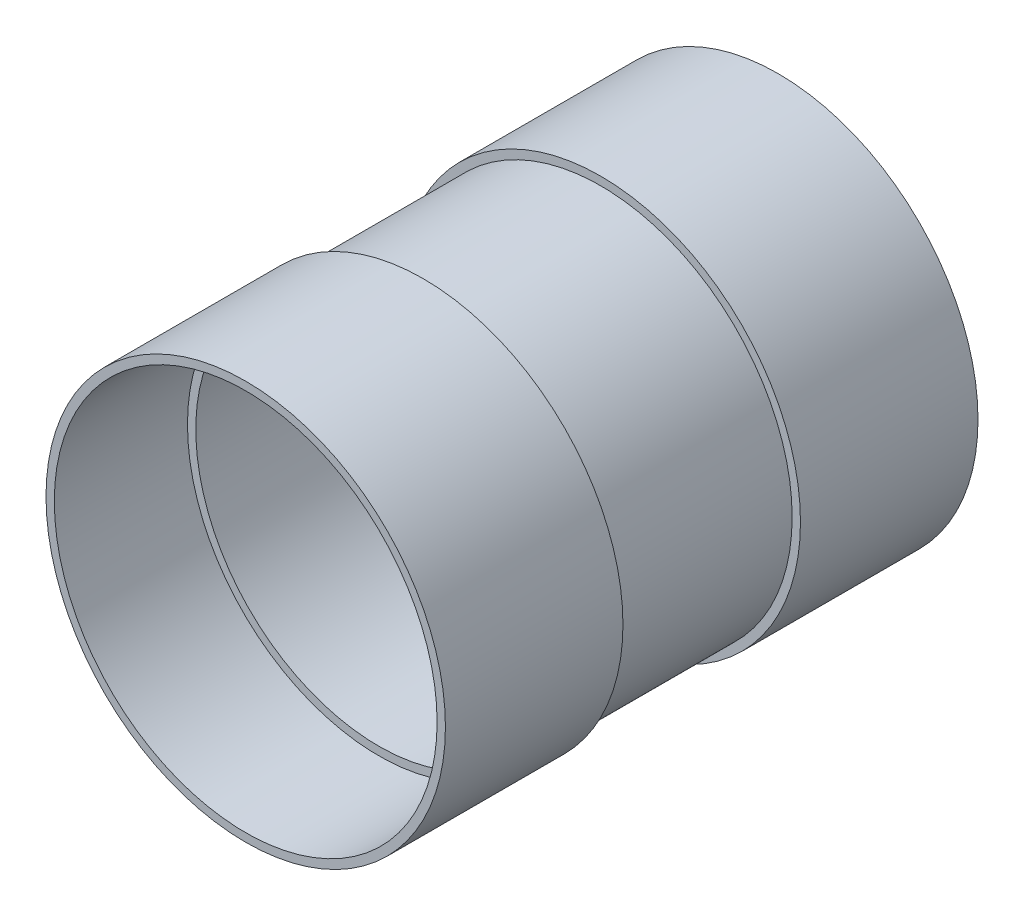
ISO-10303-21;
HEADER;
FILE_DESCRIPTION(('STEP AP214'),'2;1');
FILE_NAME('part.step','',(''),(''),'','','');
FILE_SCHEMA(('AUTOMOTIVE_DESIGN { 1 0 10303 214 1 1 1 1 }'));
ENDSEC;
DATA;
#1=APPLICATION_CONTEXT('core data for automotive mechanical design processes');
#2=APPLICATION_PROTOCOL_DEFINITION('international standard','automotive_design',2000,#1);
#3=PRODUCT_CONTEXT('',#1,'mechanical');
#4=PRODUCT('Part','Part','',(#3));
#5=PRODUCT_RELATED_PRODUCT_CATEGORY('part','',(#4));
#6=PRODUCT_DEFINITION_FORMATION('','',#4);
#7=PRODUCT_DEFINITION_CONTEXT('part definition',#1,'design');
#8=PRODUCT_DEFINITION('design','',#6,#7);
#9=PRODUCT_DEFINITION_SHAPE('','',#8);
#10=(LENGTH_UNIT() NAMED_UNIT(*) SI_UNIT(.MILLI.,.METRE.));
#11=(NAMED_UNIT(*) PLANE_ANGLE_UNIT() SI_UNIT($,.RADIAN.));
#12=(NAMED_UNIT(*) SI_UNIT($,.STERADIAN.) SOLID_ANGLE_UNIT());
#13=UNCERTAINTY_MEASURE_WITH_UNIT(LENGTH_MEASURE(1.E-05),#10,'distance_accuracy_value','');
#14=(GEOMETRIC_REPRESENTATION_CONTEXT(3) GLOBAL_UNCERTAINTY_ASSIGNED_CONTEXT((#13)) GLOBAL_UNIT_ASSIGNED_CONTEXT((#10,
#11,#12)) REPRESENTATION_CONTEXT('',''));
#15=CARTESIAN_POINT('',(0.,0.,0.));
#16=DIRECTION('',(0.,0.,1.));
#17=DIRECTION('',(1.,0.,0.));
#18=AXIS2_PLACEMENT_3D('',#15,#16,#17);
#19=CARTESIAN_POINT('',(0.,104.775,76.2000000000001));
#20=DIRECTION('',(0.,0.,-1.));
#21=DIRECTION('',(-1.,0.,0.));
#22=AXIS2_PLACEMENT_3D('',#19,#20,#21);
#23=PLANE('',#22);
#24=CARTESIAN_POINT('',(0.,0.,76.2000000000001));
#25=DIRECTION('',(0.,0.,1.));
#26=DIRECTION('',(1.,0.,0.));
#27=AXIS2_PLACEMENT_3D('',#24,#25,#26);
#28=CIRCLE('',#27,104.775);
#29=CARTESIAN_POINT('',(104.775,0.,76.2000000000001));
#30=VERTEX_POINT('',#29);
#31=EDGE_CURVE('E73',#30,#30,#28,.T.);
#32=ORIENTED_EDGE('',*,*,#31,.F.);
#33=EDGE_LOOP('',(#32));
#34=FACE_BOUND('',#33,.T.);
#35=CARTESIAN_POINT('',(0.,0.,76.2000000000001));
#36=DIRECTION('',(0.,0.,1.));
#37=DIRECTION('',(1.,0.,0.));
#38=AXIS2_PLACEMENT_3D('',#35,#36,#37);
#39=CIRCLE('',#38,109.5375);
#40=CARTESIAN_POINT('',(109.5375,0.,76.2000000000001));
#41=VERTEX_POINT('',#40);
#42=EDGE_CURVE('E11',#41,#41,#39,.T.);
#43=ORIENTED_EDGE('',*,*,#42,.T.);
#44=EDGE_LOOP('',(#43));
#45=FACE_BOUND('',#44,.T.);
#46=ADVANCED_FACE('F52',(#34,#45),#23,.F.);
#47=CARTESIAN_POINT('',(0.,0.,0.));
#48=DIRECTION('',(0.,0.,1.));
#49=DIRECTION('',(1.,0.,0.));
#50=AXIS2_PLACEMENT_3D('',#47,#48,#49);
#51=CYLINDRICAL_SURFACE('',#50,109.5375);
#52=ORIENTED_EDGE('',*,*,#42,.F.);
#53=EDGE_LOOP('',(#52));
#54=FACE_BOUND('',#53,.T.);
#55=CARTESIAN_POINT('',(0.,0.,-76.2000000000001));
#56=DIRECTION('',(0.,0.,1.));
#57=DIRECTION('',(1.,0.,0.));
#58=AXIS2_PLACEMENT_3D('',#55,#56,#57);
#59=CIRCLE('',#58,109.5375);
#60=CARTESIAN_POINT('',(109.5375,0.,-76.2000000000001));
#61=VERTEX_POINT('',#60);
#62=EDGE_CURVE('E59',#61,#61,#59,.T.);
#63=ORIENTED_EDGE('',*,*,#62,.T.);
#64=EDGE_LOOP('',(#63));
#65=FACE_BOUND('',#64,.T.);
#66=ADVANCED_FACE('F85',(#54,#65),#51,.T.);
#67=CARTESIAN_POINT('',(0.,104.775,-76.2000000000001));
#68=DIRECTION('',(0.,0.,1.));
#69=DIRECTION('',(1.,0.,0.));
#70=AXIS2_PLACEMENT_3D('',#67,#68,#69);
#71=PLANE('',#70);
#72=ORIENTED_EDGE('',*,*,#62,.F.);
#73=EDGE_LOOP('',(#72));
#74=FACE_BOUND('',#73,.T.);
#75=CARTESIAN_POINT('',(0.,0.,-76.2000000000001));
#76=DIRECTION('',(0.,0.,1.));
#77=DIRECTION('',(1.,0.,0.));
#78=AXIS2_PLACEMENT_3D('',#75,#76,#77);
#79=CIRCLE('',#78,104.775);
#80=CARTESIAN_POINT('',(104.775,0.,-76.2000000000001));
#81=VERTEX_POINT('',#80);
#82=EDGE_CURVE('E66',#81,#81,#79,.T.);
#83=ORIENTED_EDGE('',*,*,#82,.T.);
#84=EDGE_LOOP('',(#83));
#85=FACE_BOUND('',#84,.T.);
#86=ADVANCED_FACE('F89',(#74,#85),#71,.F.);
#87=CARTESIAN_POINT('',(0.,0.,0.));
#88=DIRECTION('',(0.,0.,1.));
#89=DIRECTION('',(1.,0.,0.));
#90=AXIS2_PLACEMENT_3D('',#87,#88,#89);
#91=CYLINDRICAL_SURFACE('',#90,104.775);
#92=ORIENTED_EDGE('',*,*,#82,.F.);
#93=EDGE_LOOP('',(#92));
#94=FACE_BOUND('',#93,.T.);
#95=ORIENTED_EDGE('',*,*,#31,.T.);
#96=EDGE_LOOP('',(#95));
#97=FACE_BOUND('',#96,.T.);
#98=ADVANCED_FACE('F82',(#94,#97),#91,.F.);
#99=CLOSED_SHELL('',(#46,#66,#86,#98));
#100=MANIFOLD_SOLID_BREP('B2',#99);
#101=CARTESIAN_POINT('',(0.,114.3,-50.8000000000001));
#102=DIRECTION('',(0.,0.,-1.));
#103=DIRECTION('',(-1.,0.,0.));
#104=AXIS2_PLACEMENT_3D('',#101,#102,#103);
#105=PLANE('',#104);
#106=CARTESIAN_POINT('',(0.,0.,-50.8000000000001));
#107=DIRECTION('',(0.,0.,1.));
#108=DIRECTION('',(1.,0.,0.));
#109=AXIS2_PLACEMENT_3D('',#106,#107,#108);
#110=CIRCLE('',#109,109.5375);
#111=CARTESIAN_POINT('',(109.5375,0.,-50.8000000000001));
#112=VERTEX_POINT('',#111);
#113=EDGE_CURVE('E51',#112,#112,#110,.T.);
#114=ORIENTED_EDGE('',*,*,#113,.F.);
#115=EDGE_LOOP('',(#114));
#116=FACE_BOUND('',#115,.T.);
#117=CARTESIAN_POINT('',(0.,0.,-50.8000000000001));
#118=DIRECTION('',(0.,0.,1.));
#119=DIRECTION('',(1.,0.,0.));
#120=AXIS2_PLACEMENT_3D('',#117,#118,#119);
#121=CIRCLE('',#120,114.3);
#122=CARTESIAN_POINT('',(114.3,0.,-50.8000000000001));
#123=VERTEX_POINT('',#122);
#124=EDGE_CURVE('E160',#123,#123,#121,.T.);
#125=ORIENTED_EDGE('',*,*,#124,.T.);
#126=EDGE_LOOP('',(#125));
#127=FACE_BOUND('',#126,.T.);
#128=ADVANCED_FACE('F141',(#116,#127),#105,.F.);
#129=CARTESIAN_POINT('',(0.,0.,62.5945817490495));
#130=DIRECTION('',(0.,0.,1.));
#131=DIRECTION('',(1.,0.,0.));
#132=AXIS2_PLACEMENT_3D('',#129,#130,#131);
#133=CYLINDRICAL_SURFACE('',#132,109.5375);
#134=CARTESIAN_POINT('',(0.,0.,-152.4));
#135=DIRECTION('',(0.,0.,1.));
#136=DIRECTION('',(1.,0.,0.));
#137=AXIS2_PLACEMENT_3D('',#134,#135,#136);
#138=CIRCLE('',#137,109.5375);
#139=CARTESIAN_POINT('',(109.5375,0.,-152.4));
#140=VERTEX_POINT('',#139);
#141=EDGE_CURVE('E148',#140,#140,#138,.T.);
#142=ORIENTED_EDGE('',*,*,#141,.F.);
#143=EDGE_LOOP('',(#142));
#144=FACE_BOUND('',#143,.T.);
#145=ORIENTED_EDGE('',*,*,#113,.T.);
#146=EDGE_LOOP('',(#145));
#147=FACE_BOUND('',#146,.T.);
#148=ADVANCED_FACE('F177',(#144,#147),#133,.F.);
#149=CARTESIAN_POINT('',(0.,114.3,-152.4));
#150=DIRECTION('',(0.,0.,1.));
#151=DIRECTION('',(1.,0.,0.));
#152=AXIS2_PLACEMENT_3D('',#149,#150,#151);
#153=PLANE('',#152);
#154=CARTESIAN_POINT('',(0.,0.,-152.4));
#155=DIRECTION('',(0.,0.,1.));
#156=DIRECTION('',(1.,0.,0.));
#157=AXIS2_PLACEMENT_3D('',#154,#155,#156);
#158=CIRCLE('',#157,114.3);
#159=CARTESIAN_POINT('',(114.3,0.,-152.4));
#160=VERTEX_POINT('',#159);
#161=EDGE_CURVE('E154',#160,#160,#158,.T.);
#162=ORIENTED_EDGE('',*,*,#161,.F.);
#163=EDGE_LOOP('',(#162));
#164=FACE_BOUND('',#163,.T.);
#165=ORIENTED_EDGE('',*,*,#141,.T.);
#166=EDGE_LOOP('',(#165));
#167=FACE_BOUND('',#166,.T.);
#168=ADVANCED_FACE('F172',(#164,#167),#153,.F.);
#169=CARTESIAN_POINT('',(0.,0.,62.5945817490495));
#170=DIRECTION('',(0.,0.,1.));
#171=DIRECTION('',(1.,0.,0.));
#172=AXIS2_PLACEMENT_3D('',#169,#170,#171);
#173=CYLINDRICAL_SURFACE('',#172,114.3);
#174=ORIENTED_EDGE('',*,*,#124,.F.);
#175=EDGE_LOOP('',(#174));
#176=FACE_BOUND('',#175,.T.);
#177=ORIENTED_EDGE('',*,*,#161,.T.);
#178=EDGE_LOOP('',(#177));
#179=FACE_BOUND('',#178,.T.);
#180=ADVANCED_FACE('F169',(#176,#179),#173,.T.);
#181=CLOSED_SHELL('',(#128,#148,#168,#180));
#182=MANIFOLD_SOLID_BREP('B6',#181);
#183=CARTESIAN_POINT('',(0.,109.5375,152.4));
#184=DIRECTION('',(0.,0.,-1.));
#185=DIRECTION('',(-1.,0.,0.));
#186=AXIS2_PLACEMENT_3D('',#183,#184,#185);
#187=PLANE('',#186);
#188=CARTESIAN_POINT('',(0.,0.,152.4));
#189=DIRECTION('',(0.,0.,1.));
#190=DIRECTION('',(1.,0.,0.));
#191=AXIS2_PLACEMENT_3D('',#188,#189,#190);
#192=CIRCLE('',#191,109.5375);
#193=CARTESIAN_POINT('',(109.5375,0.,152.4));
#194=VERTEX_POINT('',#193);
#195=EDGE_CURVE('E238',#194,#194,#192,.T.);
#196=ORIENTED_EDGE('',*,*,#195,.F.);
#197=EDGE_LOOP('',(#196));
#198=FACE_BOUND('',#197,.T.);
#199=CARTESIAN_POINT('',(0.,0.,152.4));
#200=DIRECTION('',(0.,0.,1.));
#201=DIRECTION('',(1.,0.,0.));
#202=AXIS2_PLACEMENT_3D('',#199,#200,#201);
#203=CIRCLE('',#202,114.3);
#204=CARTESIAN_POINT('',(114.3,0.,152.4));
#205=VERTEX_POINT('',#204);
#206=EDGE_CURVE('E140',#205,#205,#203,.T.);
#207=ORIENTED_EDGE('',*,*,#206,.T.);
#208=EDGE_LOOP('',(#207));
#209=FACE_BOUND('',#208,.T.);
#210=ADVANCED_FACE('F219',(#198,#209),#187,.F.);
#211=CARTESIAN_POINT('',(0.,0.,62.5945817490495));
#212=DIRECTION('',(0.,0.,1.));
#213=DIRECTION('',(1.,0.,0.));
#214=AXIS2_PLACEMENT_3D('',#211,#212,#213);
#215=CYLINDRICAL_SURFACE('',#214,114.3);
#216=ORIENTED_EDGE('',*,*,#206,.F.);
#217=EDGE_LOOP('',(#216));
#218=FACE_BOUND('',#217,.T.);
#219=CARTESIAN_POINT('',(0.,0.,50.8000000000001));
#220=DIRECTION('',(0.,0.,1.));
#221=DIRECTION('',(1.,0.,0.));
#222=AXIS2_PLACEMENT_3D('',#219,#220,#221);
#223=CIRCLE('',#222,114.3);
#224=CARTESIAN_POINT('',(114.3,0.,50.8000000000001));
#225=VERTEX_POINT('',#224);
#226=EDGE_CURVE('E226',#225,#225,#223,.T.);
#227=ORIENTED_EDGE('',*,*,#226,.T.);
#228=EDGE_LOOP('',(#227));
#229=FACE_BOUND('',#228,.T.);
#230=ADVANCED_FACE('F249',(#218,#229),#215,.T.);
#231=CARTESIAN_POINT('',(0.,114.3,50.8000000000001));
#232=DIRECTION('',(0.,0.,1.));
#233=DIRECTION('',(1.,0.,0.));
#234=AXIS2_PLACEMENT_3D('',#231,#232,#233);
#235=PLANE('',#234);
#236=ORIENTED_EDGE('',*,*,#226,.F.);
#237=EDGE_LOOP('',(#236));
#238=FACE_BOUND('',#237,.T.);
#239=CARTESIAN_POINT('',(0.,0.,50.8000000000001));
#240=DIRECTION('',(0.,0.,1.));
#241=DIRECTION('',(1.,0.,0.));
#242=AXIS2_PLACEMENT_3D('',#239,#240,#241);
#243=CIRCLE('',#242,109.5375);
#244=CARTESIAN_POINT('',(109.5375,0.,50.8000000000001));
#245=VERTEX_POINT('',#244);
#246=EDGE_CURVE('E232',#245,#245,#243,.T.);
#247=ORIENTED_EDGE('',*,*,#246,.T.);
#248=EDGE_LOOP('',(#247));
#249=FACE_BOUND('',#248,.T.);
#250=ADVANCED_FACE('F253',(#238,#249),#235,.F.);
#251=CARTESIAN_POINT('',(0.,0.,62.5945817490495));
#252=DIRECTION('',(0.,0.,1.));
#253=DIRECTION('',(1.,0.,0.));
#254=AXIS2_PLACEMENT_3D('',#251,#252,#253);
#255=CYLINDRICAL_SURFACE('',#254,109.5375);
#256=ORIENTED_EDGE('',*,*,#246,.F.);
#257=EDGE_LOOP('',(#256));
#258=FACE_BOUND('',#257,.T.);
#259=ORIENTED_EDGE('',*,*,#195,.T.);
#260=EDGE_LOOP('',(#259));
#261=FACE_BOUND('',#260,.T.);
#262=ADVANCED_FACE('F246',(#258,#261),#255,.F.);
#263=CLOSED_SHELL('',(#210,#230,#250,#262));
#264=MANIFOLD_SOLID_BREP('B46',#263);
#265=ADVANCED_BREP_SHAPE_REPRESENTATION('',(#18,#100,#182,#264),#14);
#266=SHAPE_DEFINITION_REPRESENTATION(#9,#265);
ENDSEC;
END-ISO-10303-21;
